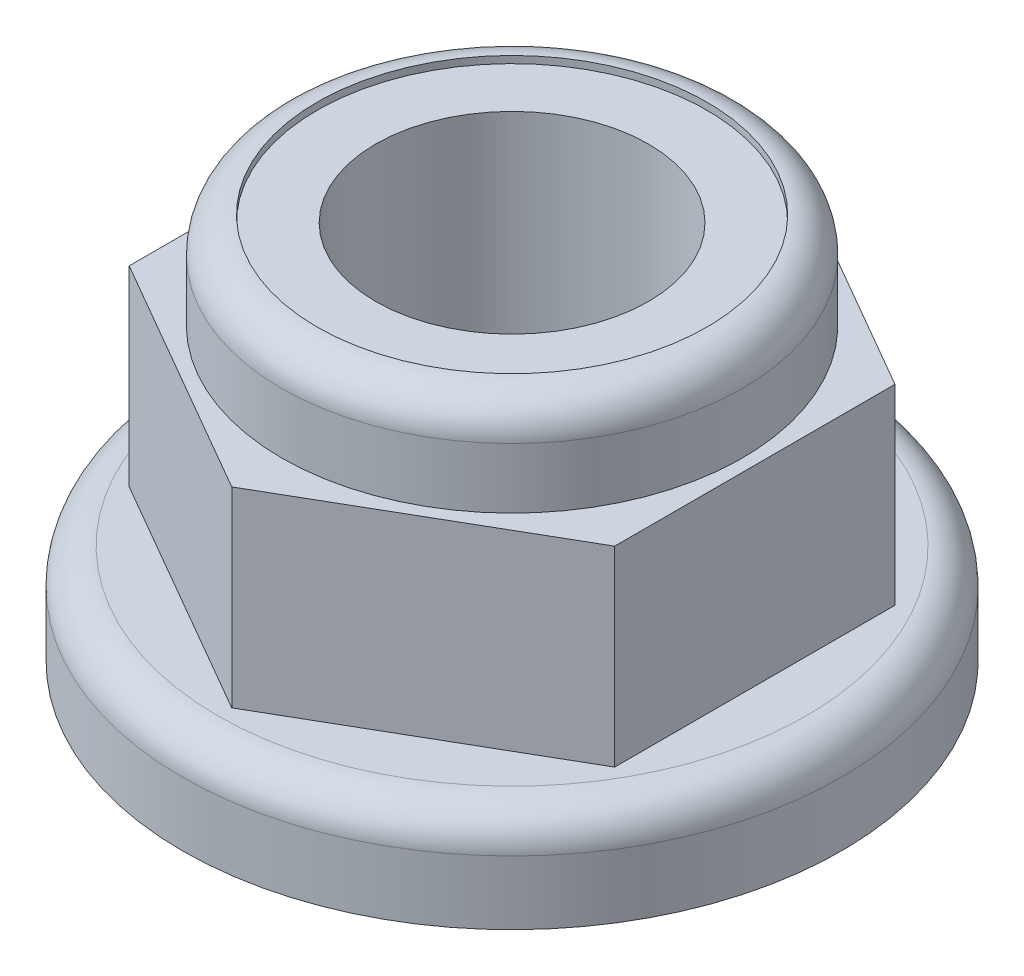
ISO-10303-21;
HEADER;
FILE_DESCRIPTION(('STEP AP214'),'2;1');
FILE_NAME('part.step','',(''),(''),'','','');
FILE_SCHEMA(('AUTOMOTIVE_DESIGN { 1 0 10303 214 1 1 1 1 }'));
ENDSEC;
DATA;
#1=APPLICATION_CONTEXT('core data for automotive mechanical design processes');
#2=APPLICATION_PROTOCOL_DEFINITION('international standard','automotive_design',2000,#1);
#3=PRODUCT_CONTEXT('',#1,'mechanical');
#4=PRODUCT('Part','Part','',(#3));
#5=PRODUCT_RELATED_PRODUCT_CATEGORY('part','',(#4));
#6=PRODUCT_DEFINITION_FORMATION('','',#4);
#7=PRODUCT_DEFINITION_CONTEXT('part definition',#1,'design');
#8=PRODUCT_DEFINITION('design','',#6,#7);
#9=PRODUCT_DEFINITION_SHAPE('','',#8);
#10=(LENGTH_UNIT() NAMED_UNIT(*) SI_UNIT(.MILLI.,.METRE.));
#11=(NAMED_UNIT(*) PLANE_ANGLE_UNIT() SI_UNIT($,.RADIAN.));
#12=(NAMED_UNIT(*) SI_UNIT($,.STERADIAN.) SOLID_ANGLE_UNIT());
#13=UNCERTAINTY_MEASURE_WITH_UNIT(LENGTH_MEASURE(1.E-05),#10,'distance_accuracy_value','');
#14=(GEOMETRIC_REPRESENTATION_CONTEXT(3) GLOBAL_UNCERTAINTY_ASSIGNED_CONTEXT((#13)) GLOBAL_UNIT_ASSIGNED_CONTEXT((#10,
#11,#12)) REPRESENTATION_CONTEXT('',''));
#15=CARTESIAN_POINT('',(0.,0.,0.));
#16=DIRECTION('',(0.,0.,1.));
#17=DIRECTION('',(1.,0.,0.));
#18=AXIS2_PLACEMENT_3D('',#15,#16,#17);
#19=CARTESIAN_POINT('',(0.,-0.00100000000000013,0.));
#20=DIRECTION('',(0.,1.,0.));
#21=DIRECTION('',(0.,0.,1.));
#22=AXIS2_PLACEMENT_3D('',#19,#20,#21);
#23=CYLINDRICAL_SURFACE('',#22,1.925);
#24=CARTESIAN_POINT('',(0.,0.,0.));
#25=DIRECTION('',(0.,1.,0.));
#26=DIRECTION('',(0.,0.,1.));
#27=AXIS2_PLACEMENT_3D('',#24,#25,#26);
#28=CIRCLE('',#27,1.925);
#29=CARTESIAN_POINT('',(0.,0.,1.925));
#30=VERTEX_POINT('',#29);
#31=EDGE_CURVE('E300',#30,#30,#28,.F.);
#32=ORIENTED_EDGE('',*,*,#31,.T.);
#33=EDGE_LOOP('',(#32));
#34=FACE_BOUND('',#33,.T.);
#35=CARTESIAN_POINT('',(0.,5.35,0.));
#36=DIRECTION('',(0.,1.,0.));
#37=DIRECTION('',(0.,0.,1.));
#38=AXIS2_PLACEMENT_3D('',#35,#36,#37);
#39=CIRCLE('',#38,1.925);
#40=CARTESIAN_POINT('',(0.,5.35,1.925));
#41=VERTEX_POINT('',#40);
#42=EDGE_CURVE('E296',#41,#41,#39,.T.);
#43=ORIENTED_EDGE('',*,*,#42,.T.);
#44=EDGE_LOOP('',(#43));
#45=FACE_BOUND('',#44,.T.);
#46=ADVANCED_FACE('F46',(#34,#45),#23,.F.);
#47=CARTESIAN_POINT('',(0.,1.4,0.));
#48=DIRECTION('',(0.,1.,0.));
#49=DIRECTION('',(0.,0.,1.));
#50=AXIS2_PLACEMENT_3D('',#47,#48,#49);
#51=PLANE('',#50);
#52=CARTESIAN_POINT('',(0.,1.4,0.));
#53=DIRECTION('',(0.,1.,0.));
#54=DIRECTION('',(0.,0.,1.));
#55=AXIS2_PLACEMENT_3D('',#52,#53,#54);
#56=CIRCLE('',#55,4.15);
#57=CARTESIAN_POINT('',(0.,1.4,4.15));
#58=VERTEX_POINT('',#57);
#59=EDGE_CURVE('E54',#58,#58,#56,.T.);
#60=ORIENTED_EDGE('',*,*,#59,.T.);
#61=EDGE_LOOP('',(#60));
#62=FACE_BOUND('',#61,.T.);
#63=DIRECTION('',(0.866025403784438,0.,-0.5));
#64=VECTOR('',#63,1.);
#65=CARTESIAN_POINT('',(0.,1.4,3.95484934394894));
#66=LINE('',#65,#64);
#67=CARTESIAN_POINT('',(0.,1.4,3.95484934394894));
#68=VERTEX_POINT('',#67);
#69=CARTESIAN_POINT('',(3.425,1.4,1.97742467197447));
#70=VERTEX_POINT('',#69);
#71=EDGE_CURVE('E133',#68,#70,#66,.T.);
#72=ORIENTED_EDGE('',*,*,#71,.F.);
#73=DIRECTION('',(0.866025403784438,0.,0.5));
#74=VECTOR('',#73,1.);
#75=CARTESIAN_POINT('',(-3.425,1.4,1.97742467197447));
#76=LINE('',#75,#74);
#77=CARTESIAN_POINT('',(-3.425,1.4,1.97742467197447));
#78=VERTEX_POINT('',#77);
#79=EDGE_CURVE('E130',#78,#68,#76,.T.);
#80=ORIENTED_EDGE('',*,*,#79,.F.);
#81=DIRECTION('',(0.,0.,1.));
#82=VECTOR('',#81,1.);
#83=CARTESIAN_POINT('',(-3.425,1.4,-1.97742467197447));
#84=LINE('',#83,#82);
#85=CARTESIAN_POINT('',(-3.425,1.4,-1.97742467197447));
#86=VERTEX_POINT('',#85);
#87=EDGE_CURVE('E89',#86,#78,#84,.T.);
#88=ORIENTED_EDGE('',*,*,#87,.F.);
#89=DIRECTION('',(-0.866025403784439,0.,0.5));
#90=VECTOR('',#89,1.);
#91=CARTESIAN_POINT('',(0.,1.4,-3.95484934394894));
#92=LINE('',#91,#90);
#93=CARTESIAN_POINT('',(0.,1.4,-3.95484934394894));
#94=VERTEX_POINT('',#93);
#95=EDGE_CURVE('E139',#94,#86,#92,.T.);
#96=ORIENTED_EDGE('',*,*,#95,.F.);
#97=DIRECTION('',(-0.866025403784439,0.,-0.5));
#98=VECTOR('',#97,1.);
#99=CARTESIAN_POINT('',(3.425,1.4,-1.97742467197447));
#100=LINE('',#99,#98);
#101=CARTESIAN_POINT('',(3.425,1.4,-1.97742467197447));
#102=VERTEX_POINT('',#101);
#103=EDGE_CURVE('E119',#102,#94,#100,.T.);
#104=ORIENTED_EDGE('',*,*,#103,.F.);
#105=DIRECTION('',(0.,0.,-1.));
#106=VECTOR('',#105,1.);
#107=CARTESIAN_POINT('',(3.425,1.4,1.97742467197447));
#108=LINE('',#107,#106);
#109=EDGE_CURVE('E136',#70,#102,#108,.T.);
#110=ORIENTED_EDGE('',*,*,#109,.F.);
#111=EDGE_LOOP('',(#72,#80,#88,#96,#104,#110));
#112=FACE_BOUND('',#111,.T.);
#113=ADVANCED_FACE('F159',(#62,#112),#51,.T.);
#114=CARTESIAN_POINT('',(0.,1.4,0.));
#115=DIRECTION('',(0.,-1.,0.));
#116=DIRECTION('',(0.,0.,-1.));
#117=AXIS2_PLACEMENT_3D('',#114,#115,#116);
#118=CYLINDRICAL_SURFACE('',#117,4.65);
#119=CARTESIAN_POINT('',(0.,0.9,0.));
#120=DIRECTION('',(0.,1.,0.));
#121=DIRECTION('',(0.,0.,1.));
#122=AXIS2_PLACEMENT_3D('',#119,#120,#121);
#123=CIRCLE('',#122,4.65);
#124=CARTESIAN_POINT('',(0.,0.9,4.65));
#125=VERTEX_POINT('',#124);
#126=EDGE_CURVE('E13',#125,#125,#123,.F.);
#127=ORIENTED_EDGE('',*,*,#126,.T.);
#128=EDGE_LOOP('',(#127));
#129=FACE_BOUND('',#128,.T.);
#130=CARTESIAN_POINT('',(0.,0.,0.));
#131=DIRECTION('',(0.,1.,0.));
#132=DIRECTION('',(0.,0.,1.));
#133=AXIS2_PLACEMENT_3D('',#130,#131,#132);
#134=CIRCLE('',#133,4.65);
#135=CARTESIAN_POINT('',(0.,0.,4.65));
#136=VERTEX_POINT('',#135);
#137=EDGE_CURVE('E151',#136,#136,#134,.T.);
#138=ORIENTED_EDGE('',*,*,#137,.T.);
#139=EDGE_LOOP('',(#138));
#140=FACE_BOUND('',#139,.T.);
#141=ADVANCED_FACE('F182',(#129,#140),#118,.T.);
#142=CARTESIAN_POINT('',(0.,0.,0.));
#143=DIRECTION('',(0.,1.,0.));
#144=DIRECTION('',(0.,0.,1.));
#145=AXIS2_PLACEMENT_3D('',#142,#143,#144);
#146=PLANE('',#145);
#147=ORIENTED_EDGE('',*,*,#31,.F.);
#148=EDGE_LOOP('',(#147));
#149=FACE_BOUND('',#148,.T.);
#150=ORIENTED_EDGE('',*,*,#137,.F.);
#151=EDGE_LOOP('',(#150));
#152=FACE_BOUND('',#151,.T.);
#153=ADVANCED_FACE('F210',(#149,#152),#146,.F.);
#154=CARTESIAN_POINT('',(-3.425,4.1,1.97742467197447));
#155=DIRECTION('',(0.5,0.,-0.866025403784438));
#156=DIRECTION('',(-0.866025403784439,0.,-0.5));
#157=AXIS2_PLACEMENT_3D('',#154,#155,#156);
#158=PLANE('',#157);
#159=ORIENTED_EDGE('',*,*,#79,.T.);
#160=DIRECTION('',(0.,-1.,0.));
#161=VECTOR('',#160,1.);
#162=CARTESIAN_POINT('',(0.,4.1,3.95484934394894));
#163=LINE('',#162,#161);
#164=CARTESIAN_POINT('',(0.,4.1,3.95484934394894));
#165=VERTEX_POINT('',#164);
#166=EDGE_CURVE('E149',#165,#68,#163,.T.);
#167=ORIENTED_EDGE('',*,*,#166,.F.);
#168=DIRECTION('',(0.866025403784438,0.,0.5));
#169=VECTOR('',#168,1.);
#170=CARTESIAN_POINT('',(-3.425,4.1,1.97742467197447));
#171=LINE('',#170,#169);
#172=CARTESIAN_POINT('',(-3.425,4.1,1.97742467197447));
#173=VERTEX_POINT('',#172);
#174=EDGE_CURVE('E142',#173,#165,#171,.T.);
#175=ORIENTED_EDGE('',*,*,#174,.F.);
#176=DIRECTION('',(0.,-1.,0.));
#177=VECTOR('',#176,1.);
#178=CARTESIAN_POINT('',(-3.425,4.1,1.97742467197447));
#179=LINE('',#178,#177);
#180=EDGE_CURVE('E126',#173,#78,#179,.T.);
#181=ORIENTED_EDGE('',*,*,#180,.T.);
#182=EDGE_LOOP('',(#159,#167,#175,#181));
#183=FACE_BOUND('',#182,.T.);
#184=ADVANCED_FACE('F208',(#183),#158,.F.);
#185=CARTESIAN_POINT('',(0.,4.1,3.95484934394894));
#186=DIRECTION('',(-0.5,0.,-0.866025403784438));
#187=DIRECTION('',(-0.866025403784438,0.,0.5));
#188=AXIS2_PLACEMENT_3D('',#185,#186,#187);
#189=PLANE('',#188);
#190=ORIENTED_EDGE('',*,*,#71,.T.);
#191=DIRECTION('',(0.,-1.,0.));
#192=VECTOR('',#191,1.);
#193=CARTESIAN_POINT('',(3.425,4.1,1.97742467197447));
#194=LINE('',#193,#192);
#195=CARTESIAN_POINT('',(3.425,4.1,1.97742467197447));
#196=VERTEX_POINT('',#195);
#197=EDGE_CURVE('E146',#196,#70,#194,.T.);
#198=ORIENTED_EDGE('',*,*,#197,.F.);
#199=DIRECTION('',(0.866025403784438,0.,-0.5));
#200=VECTOR('',#199,1.);
#201=CARTESIAN_POINT('',(0.,4.1,3.95484934394894));
#202=LINE('',#201,#200);
#203=EDGE_CURVE('E97',#165,#196,#202,.T.);
#204=ORIENTED_EDGE('',*,*,#203,.F.);
#205=ORIENTED_EDGE('',*,*,#166,.T.);
#206=EDGE_LOOP('',(#190,#198,#204,#205));
#207=FACE_BOUND('',#206,.T.);
#208=ADVANCED_FACE('F204',(#207),#189,.F.);
#209=CARTESIAN_POINT('',(3.425,4.1,1.97742467197447));
#210=DIRECTION('',(-1.,0.,0.));
#211=DIRECTION('',(0.,0.,1.));
#212=AXIS2_PLACEMENT_3D('',#209,#210,#211);
#213=PLANE('',#212);
#214=ORIENTED_EDGE('',*,*,#109,.T.);
#215=DIRECTION('',(0.,-1.,0.));
#216=VECTOR('',#215,1.);
#217=CARTESIAN_POINT('',(3.425,4.1,-1.97742467197447));
#218=LINE('',#217,#216);
#219=CARTESIAN_POINT('',(3.425,4.1,-1.97742467197447));
#220=VERTEX_POINT('',#219);
#221=EDGE_CURVE('E122',#220,#102,#218,.T.);
#222=ORIENTED_EDGE('',*,*,#221,.F.);
#223=DIRECTION('',(0.,0.,-1.));
#224=VECTOR('',#223,1.);
#225=CARTESIAN_POINT('',(3.425,4.1,1.97742467197447));
#226=LINE('',#225,#224);
#227=EDGE_CURVE('E110',#196,#220,#226,.T.);
#228=ORIENTED_EDGE('',*,*,#227,.F.);
#229=ORIENTED_EDGE('',*,*,#197,.T.);
#230=EDGE_LOOP('',(#214,#222,#228,#229));
#231=FACE_BOUND('',#230,.T.);
#232=ADVANCED_FACE('F201',(#231),#213,.F.);
#233=CARTESIAN_POINT('',(3.425,4.1,-1.97742467197447));
#234=DIRECTION('',(-0.5,0.,0.866025403784439));
#235=DIRECTION('',(0.866025403784439,0.,0.5));
#236=AXIS2_PLACEMENT_3D('',#233,#234,#235);
#237=PLANE('',#236);
#238=ORIENTED_EDGE('',*,*,#103,.T.);
#239=DIRECTION('',(0.,-1.,0.));
#240=VECTOR('',#239,1.);
#241=CARTESIAN_POINT('',(0.,4.1,-3.95484934394894));
#242=LINE('',#241,#240);
#243=CARTESIAN_POINT('',(0.,4.1,-3.95484934394894));
#244=VERTEX_POINT('',#243);
#245=EDGE_CURVE('E116',#244,#94,#242,.T.);
#246=ORIENTED_EDGE('',*,*,#245,.F.);
#247=DIRECTION('',(-0.866025403784439,0.,-0.5));
#248=VECTOR('',#247,1.);
#249=CARTESIAN_POINT('',(3.425,4.1,-1.97742467197447));
#250=LINE('',#249,#248);
#251=EDGE_CURVE('E104',#220,#244,#250,.T.);
#252=ORIENTED_EDGE('',*,*,#251,.F.);
#253=ORIENTED_EDGE('',*,*,#221,.T.);
#254=EDGE_LOOP('',(#238,#246,#252,#253));
#255=FACE_BOUND('',#254,.T.);
#256=ADVANCED_FACE('F117',(#255),#237,.F.);
#257=CARTESIAN_POINT('',(0.,4.1,-3.95484934394894));
#258=DIRECTION('',(0.5,0.,0.866025403784439));
#259=DIRECTION('',(0.866025403784439,0.,-0.5));
#260=AXIS2_PLACEMENT_3D('',#257,#258,#259);
#261=PLANE('',#260);
#262=ORIENTED_EDGE('',*,*,#95,.T.);
#263=DIRECTION('',(0.,-1.,0.));
#264=VECTOR('',#263,1.);
#265=CARTESIAN_POINT('',(-3.425,4.1,-1.97742467197447));
#266=LINE('',#265,#264);
#267=CARTESIAN_POINT('',(-3.425,4.1,-1.97742467197447));
#268=VERTEX_POINT('',#267);
#269=EDGE_CURVE('E61',#268,#86,#266,.T.);
#270=ORIENTED_EDGE('',*,*,#269,.F.);
#271=DIRECTION('',(-0.866025403784439,0.,0.5));
#272=VECTOR('',#271,1.);
#273=CARTESIAN_POINT('',(0.,4.1,-3.95484934394894));
#274=LINE('',#273,#272);
#275=EDGE_CURVE('E108',#244,#268,#274,.T.);
#276=ORIENTED_EDGE('',*,*,#275,.F.);
#277=ORIENTED_EDGE('',*,*,#245,.T.);
#278=EDGE_LOOP('',(#262,#270,#276,#277));
#279=FACE_BOUND('',#278,.T.);
#280=ADVANCED_FACE('F124',(#279),#261,.F.);
#281=CARTESIAN_POINT('',(-3.425,4.1,-1.97742467197447));
#282=DIRECTION('',(1.,0.,0.));
#283=DIRECTION('',(0.,0.,-1.));
#284=AXIS2_PLACEMENT_3D('',#281,#282,#283);
#285=PLANE('',#284);
#286=ORIENTED_EDGE('',*,*,#87,.T.);
#287=ORIENTED_EDGE('',*,*,#180,.F.);
#288=DIRECTION('',(0.,0.,1.));
#289=VECTOR('',#288,1.);
#290=CARTESIAN_POINT('',(-3.425,4.1,-1.97742467197447));
#291=LINE('',#290,#289);
#292=EDGE_CURVE('E69',#268,#173,#291,.T.);
#293=ORIENTED_EDGE('',*,*,#292,.F.);
#294=ORIENTED_EDGE('',*,*,#269,.T.);
#295=EDGE_LOOP('',(#286,#287,#293,#294));
#296=FACE_BOUND('',#295,.T.);
#297=ADVANCED_FACE('F193',(#296),#285,.F.);
#298=CARTESIAN_POINT('',(0.,4.1,0.));
#299=DIRECTION('',(0.,1.,0.));
#300=DIRECTION('',(0.,0.,1.));
#301=AXIS2_PLACEMENT_3D('',#298,#299,#300);
#302=PLANE('',#301);
#303=CARTESIAN_POINT('',(0.,4.1,0.));
#304=DIRECTION('',(0.,1.,0.));
#305=DIRECTION('',(0.,0.,1.));
#306=AXIS2_PLACEMENT_3D('',#303,#304,#305);
#307=CIRCLE('',#306,3.25);
#308=CARTESIAN_POINT('',(0.,4.1,3.25));
#309=VERTEX_POINT('',#308);
#310=EDGE_CURVE('E134',#309,#309,#307,.T.);
#311=ORIENTED_EDGE('',*,*,#310,.F.);
#312=EDGE_LOOP('',(#311));
#313=FACE_BOUND('',#312,.T.);
#314=ORIENTED_EDGE('',*,*,#174,.T.);
#315=ORIENTED_EDGE('',*,*,#203,.T.);
#316=ORIENTED_EDGE('',*,*,#227,.T.);
#317=ORIENTED_EDGE('',*,*,#251,.T.);
#318=ORIENTED_EDGE('',*,*,#275,.T.);
#319=ORIENTED_EDGE('',*,*,#292,.T.);
#320=EDGE_LOOP('',(#314,#315,#316,#317,#318,#319));
#321=FACE_BOUND('',#320,.T.);
#322=ADVANCED_FACE('F106',(#313,#321),#302,.T.);
#323=CARTESIAN_POINT('',(0.,5.45,0.));
#324=DIRECTION('',(0.,-1.,0.));
#325=DIRECTION('',(0.,0.,-1.));
#326=AXIS2_PLACEMENT_3D('',#323,#324,#325);
#327=CYLINDRICAL_SURFACE('',#326,3.25);
#328=CARTESIAN_POINT('',(0.,4.95,0.));
#329=DIRECTION('',(0.,1.,0.));
#330=DIRECTION('',(0.,0.,1.));
#331=AXIS2_PLACEMENT_3D('',#328,#329,#330);
#332=CIRCLE('',#331,3.25);
#333=CARTESIAN_POINT('',(0.,4.95,3.25));
#334=VERTEX_POINT('',#333);
#335=EDGE_CURVE('E154',#334,#334,#332,.F.);
#336=ORIENTED_EDGE('',*,*,#335,.T.);
#337=EDGE_LOOP('',(#336));
#338=FACE_BOUND('',#337,.T.);
#339=ORIENTED_EDGE('',*,*,#310,.T.);
#340=EDGE_LOOP('',(#339));
#341=FACE_BOUND('',#340,.T.);
#342=ADVANCED_FACE('F173',(#338,#341),#327,.T.);
#343=CARTESIAN_POINT('',(0.,4.95,0.));
#344=DIRECTION('',(0.,1.,0.));
#345=DIRECTION('',(0.,0.,1.));
#346=AXIS2_PLACEMENT_3D('',#343,#344,#345);
#347=TOROIDAL_SURFACE('',#346,2.75,0.5);
#348=ORIENTED_EDGE('',*,*,#335,.F.);
#349=EDGE_LOOP('',(#348));
#350=FACE_BOUND('',#349,.T.);
#351=CARTESIAN_POINT('',(0.,5.45,0.));
#352=DIRECTION('',(0.,1.,0.));
#353=DIRECTION('',(0.,0.,1.));
#354=AXIS2_PLACEMENT_3D('',#351,#352,#353);
#355=CIRCLE('',#354,2.75);
#356=CARTESIAN_POINT('',(0.,5.45,2.75));
#357=VERTEX_POINT('',#356);
#358=EDGE_CURVE('E301',#357,#357,#355,.T.);
#359=ORIENTED_EDGE('',*,*,#358,.F.);
#360=EDGE_LOOP('',(#359));
#361=FACE_BOUND('',#360,.T.);
#362=ADVANCED_FACE('F164',(#350,#361),#347,.T.);
#363=CARTESIAN_POINT('',(0.,0.9,0.));
#364=DIRECTION('',(0.,1.,0.));
#365=DIRECTION('',(0.,0.,1.));
#366=AXIS2_PLACEMENT_3D('',#363,#364,#365);
#367=TOROIDAL_SURFACE('',#366,4.15,0.5);
#368=ORIENTED_EDGE('',*,*,#126,.F.);
#369=EDGE_LOOP('',(#368));
#370=FACE_BOUND('',#369,.T.);
#371=ORIENTED_EDGE('',*,*,#59,.F.);
#372=EDGE_LOOP('',(#371));
#373=FACE_BOUND('',#372,.T.);
#374=ADVANCED_FACE('F48',(#370,#373),#367,.T.);
#375=CARTESIAN_POINT('',(0.,5.35,0.));
#376=DIRECTION('',(0.,1.,0.));
#377=DIRECTION('',(0.,0.,1.));
#378=AXIS2_PLACEMENT_3D('',#375,#376,#377);
#379=CYLINDRICAL_SURFACE('',#378,2.75);
#380=CARTESIAN_POINT('',(0.,5.35,0.));
#381=DIRECTION('',(0.,1.,0.));
#382=DIRECTION('',(0.,0.,1.));
#383=AXIS2_PLACEMENT_3D('',#380,#381,#382);
#384=CIRCLE('',#383,2.75);
#385=CARTESIAN_POINT('',(0.,5.35,2.75));
#386=VERTEX_POINT('',#385);
#387=EDGE_CURVE('E299',#386,#386,#384,.T.);
#388=ORIENTED_EDGE('',*,*,#387,.F.);
#389=EDGE_LOOP('',(#388));
#390=FACE_BOUND('',#389,.T.);
#391=ORIENTED_EDGE('',*,*,#358,.T.);
#392=EDGE_LOOP('',(#391));
#393=FACE_BOUND('',#392,.T.);
#394=ADVANCED_FACE('F163',(#390,#393),#379,.F.);
#395=CARTESIAN_POINT('',(0.,5.35,0.));
#396=DIRECTION('',(0.,1.,0.));
#397=DIRECTION('',(0.,0.,1.));
#398=AXIS2_PLACEMENT_3D('',#395,#396,#397);
#399=PLANE('',#398);
#400=ORIENTED_EDGE('',*,*,#42,.F.);
#401=EDGE_LOOP('',(#400));
#402=FACE_BOUND('',#401,.T.);
#403=ORIENTED_EDGE('',*,*,#387,.T.);
#404=EDGE_LOOP('',(#403));
#405=FACE_BOUND('',#404,.T.);
#406=ADVANCED_FACE('F170',(#402,#405),#399,.T.);
#407=CLOSED_SHELL('',(#46,#113,#141,#153,#184,#208,#232,#256,#280,#297,#322,#342,#362,#374,#394,#406));
#408=MANIFOLD_SOLID_BREP('B2',#407);
#409=ADVANCED_BREP_SHAPE_REPRESENTATION('',(#18,#408),#14);
#410=SHAPE_DEFINITION_REPRESENTATION(#9,#409);
ENDSEC;
END-ISO-10303-21;
